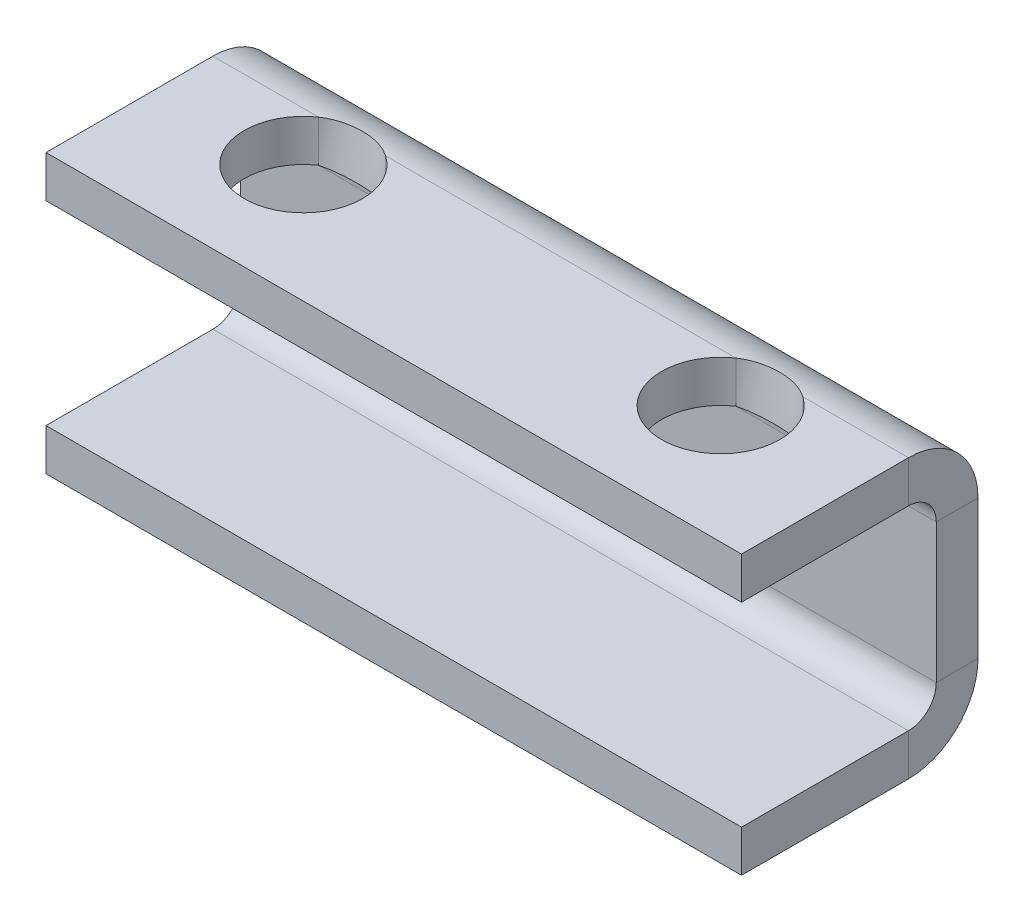
ISO-10303-21;
HEADER;
FILE_DESCRIPTION(('STEP AP214'),'2;1');
FILE_NAME('part.step','',(''),(''),'','','');
FILE_SCHEMA(('AUTOMOTIVE_DESIGN { 1 0 10303 214 1 1 1 1 }'));
ENDSEC;
DATA;
#1=APPLICATION_CONTEXT('core data for automotive mechanical design processes');
#2=APPLICATION_PROTOCOL_DEFINITION('international standard','automotive_design',2000,#1);
#3=PRODUCT_CONTEXT('',#1,'mechanical');
#4=PRODUCT('Part','Part','',(#3));
#5=PRODUCT_RELATED_PRODUCT_CATEGORY('part','',(#4));
#6=PRODUCT_DEFINITION_FORMATION('','',#4);
#7=PRODUCT_DEFINITION_CONTEXT('part definition',#1,'design');
#8=PRODUCT_DEFINITION('design','',#6,#7);
#9=PRODUCT_DEFINITION_SHAPE('','',#8);
#10=(LENGTH_UNIT() NAMED_UNIT(*) SI_UNIT(.MILLI.,.METRE.));
#11=(NAMED_UNIT(*) PLANE_ANGLE_UNIT() SI_UNIT($,.RADIAN.));
#12=(NAMED_UNIT(*) SI_UNIT($,.STERADIAN.) SOLID_ANGLE_UNIT());
#13=UNCERTAINTY_MEASURE_WITH_UNIT(LENGTH_MEASURE(1.E-05),#10,'distance_accuracy_value','');
#14=(GEOMETRIC_REPRESENTATION_CONTEXT(3) GLOBAL_UNCERTAINTY_ASSIGNED_CONTEXT((#13)) GLOBAL_UNIT_ASSIGNED_CONTEXT((#10,
#11,#12)) REPRESENTATION_CONTEXT('',''));
#15=CARTESIAN_POINT('',(0.,0.,0.));
#16=DIRECTION('',(0.,0.,1.));
#17=DIRECTION('',(1.,0.,0.));
#18=AXIS2_PLACEMENT_3D('',#15,#16,#17);
#19=CARTESIAN_POINT('',(-25.1781746195034,20.,-28.9999999999999));
#20=CARTESIAN_POINT('',(-25.8881448454651,20.,-29.4890503507054));
#21=CARTESIAN_POINT('',(-26.6525228479121,19.9662598890292,-29.8599474567213));
#22=CARTESIAN_POINT('',(-27.879730082586,19.9233446593499,-30.2424541129357));
#23=CARTESIAN_POINT('',(-28.3002915042684,19.9101349975319,-30.3391805559646));
#24=CARTESIAN_POINT('',(-29.1413465360991,19.8919903584384,-30.4672106117877));
#25=CARTESIAN_POINT('',(-29.5650505993346,19.8869216632596,-30.4995933417468));
#26=CARTESIAN_POINT('',(-30.4189072474882,19.8867994183876,-30.5003990891138));
#27=CARTESIAN_POINT('',(-30.851448520052,19.8918730372488,-30.4679956067223));
#28=CARTESIAN_POINT('',(-31.6948534565829,19.9099926816771,-30.3402269716403));
#29=CARTESIAN_POINT('',(-32.1089223545109,19.9229784768555,-30.2452166993051));
#30=CARTESIAN_POINT('',(-33.3285863915305,19.9655395361904,-29.8673451873898));
#31=CARTESIAN_POINT('',(-34.1158003298536,20.,-29.4863327869223));
#32=CARTESIAN_POINT('',(-34.8218253804965,20.,-28.9999999999999));
#33=CARTESIAN_POINT('',(-25.1781746195034,14.,-28.9999999999999));
#34=CARTESIAN_POINT('',(-25.8886428200055,14.,-29.1957573486408));
#35=CARTESIAN_POINT('',(-26.6525228479122,13.9865039556117,-29.3439789826884));
#36=CARTESIAN_POINT('',(-27.879730082586,13.9693378637399,-29.4969816451742));
#37=CARTESIAN_POINT('',(-28.3002915042684,13.9640539990128,-29.5356722223857));
#38=CARTESIAN_POINT('',(-29.1413465360991,13.9567961433753,-29.586884244715));
#39=CARTESIAN_POINT('',(-29.5650505993346,13.9547686653038,-29.5998373366986));
#40=CARTESIAN_POINT('',(-30.4189072474882,13.954719767355,-29.6001596356454));
#41=CARTESIAN_POINT('',(-30.8514485200521,13.9567492148995,-29.5871982426888));
#42=CARTESIAN_POINT('',(-31.6948534565829,13.9639970726708,-29.536090788656));
#43=CARTESIAN_POINT('',(-32.1089223545109,13.9691913907422,-29.498086679722));
#44=CARTESIAN_POINT('',(-33.3285863915305,13.9862158144761,-29.3469380749559));
#45=CARTESIAN_POINT('',(-34.1163575468358,14.,-29.1943795831695));
#46=CARTESIAN_POINT('',(-34.8218253804966,14.,-28.9999999999999));
#47=B_SPLINE_SURFACE_WITH_KNOTS('',1,3,((#19,#20,#21,#22,#23,#24,#25,#26,#27,#28,#29,#30,#31,
#32),(#33,#34,#35,#36,#37,#38,#39,#40,#41,#42,#43,#44,#45,#46)),.UNSPECIFIED.,.F.,.F.,.F.,(2,2),
(4,2,2,2,2,2,4),(0.,1.),(0.,0.00254959814953399,0.00382439722430098,0.00509919629906798,
0.00637399537383497,0.00764879444860197,0.010198392598136),.UNSPECIFIED.);
#48=CARTESIAN_POINT('',(-34.8218253804965,20.,-28.9999999999999));
#49=CARTESIAN_POINT('',(-34.8218253804966,14.,-28.9999999999999));
#50=B_SPLINE_CURVE_WITH_KNOTS('',1,(#48,#49),.UNSPECIFIED.,.F.,.F.,(2,2),(0.,1.),.UNSPECIFIED.);
#51=CARTESIAN_POINT('',(-34.8218253804966,14.,-28.9999999999999));
#52=VERTEX_POINT('',#51);
#53=CARTESIAN_POINT('',(-34.8218253804965,20.,-28.9999999999999));
#54=VERTEX_POINT('',#53);
#55=EDGE_CURVE('E11',#52,#54,#50,.F.);
#56=CARTESIAN_POINT('',(-34.8218253804966,14.,-28.9999999999999));
#57=CARTESIAN_POINT('',(-34.1163575468358,14.,-29.1943795831695));
#58=CARTESIAN_POINT('',(-33.3285863915305,13.9862158144761,-29.3469380749559));
#59=CARTESIAN_POINT('',(-32.1089223545109,13.9691913907422,-29.498086679722));
#60=CARTESIAN_POINT('',(-31.6948534565829,13.9639970726708,-29.536090788656));
#61=CARTESIAN_POINT('',(-30.8514485200521,13.9567492148995,-29.5871982426888));
#62=CARTESIAN_POINT('',(-30.4189072474882,13.954719767355,-29.6001596356454));
#63=CARTESIAN_POINT('',(-29.5650505993346,13.9547686653038,-29.5998373366986));
#64=CARTESIAN_POINT('',(-29.1413465360991,13.9567961433753,-29.586884244715));
#65=CARTESIAN_POINT('',(-28.3002915042684,13.9640539990128,-29.5356722223857));
#66=CARTESIAN_POINT('',(-27.879730082586,13.9693378637399,-29.4969816451742));
#67=CARTESIAN_POINT('',(-26.6525228479122,13.9865039556117,-29.3439789826884));
#68=CARTESIAN_POINT('',(-25.8886428200055,14.,-29.1957573486408));
#69=CARTESIAN_POINT('',(-25.1781746195034,14.,-28.9999999999999));
#70=B_SPLINE_CURVE_WITH_KNOTS('',3,(#56,#57,#58,#59,#60,#61,#62,#63,#64,#65,#66,#67,#68,#69),
.UNSPECIFIED.,.F.,.F.,(4,2,2,2,2,2,4),(0.,0.00254959814953399,0.00382439722430098,
0.00509919629906798,0.00637399537383497,0.00764879444860197,0.010198392598136),.UNSPECIFIED.);
#71=CARTESIAN_POINT('',(-25.1781746195034,14.,-28.9999999999999));
#72=VERTEX_POINT('',#71);
#73=EDGE_CURVE('E140',#72,#52,#70,.F.);
#74=CARTESIAN_POINT('',(-25.1781746195034,14.,-28.9999999999999));
#75=CARTESIAN_POINT('',(-25.1781746195034,20.,-28.9999999999999));
#76=B_SPLINE_CURVE_WITH_KNOTS('',1,(#74,#75),.UNSPECIFIED.,.F.,.F.,(2,2),(0.,1.),.UNSPECIFIED.);
#77=CARTESIAN_POINT('',(-25.1781746195034,20.,-28.9999999999999));
#78=VERTEX_POINT('',#77);
#79=EDGE_CURVE('E52',#72,#78,#76,.T.);
#80=CARTESIAN_POINT('',(-25.1781746195034,20.,-28.9999999999999));
#81=CARTESIAN_POINT('',(-25.8881448454651,20.,-29.4890503507054));
#82=CARTESIAN_POINT('',(-26.6525228479121,19.9662598890292,-29.8599474567213));
#83=CARTESIAN_POINT('',(-27.879730082586,19.9233446593499,-30.2424541129357));
#84=CARTESIAN_POINT('',(-28.3002915042684,19.9101349975319,-30.3391805559646));
#85=CARTESIAN_POINT('',(-29.1413465360991,19.8919903584384,-30.4672106117877));
#86=CARTESIAN_POINT('',(-29.5650505993346,19.8869216632596,-30.4995933417468));
#87=CARTESIAN_POINT('',(-30.4189072474882,19.8867994183876,-30.5003990891138));
#88=CARTESIAN_POINT('',(-30.851448520052,19.8918730372488,-30.4679956067223));
#89=CARTESIAN_POINT('',(-31.6948534565829,19.9099926816771,-30.3402269716403));
#90=CARTESIAN_POINT('',(-32.1089223545109,19.9229784768555,-30.2452166993051));
#91=CARTESIAN_POINT('',(-33.3285863915305,19.9655395361904,-29.8673451873898));
#92=CARTESIAN_POINT('',(-34.1158003298536,20.,-29.4863327869223));
#93=CARTESIAN_POINT('',(-34.8218253804965,20.,-28.9999999999999));
#94=B_SPLINE_CURVE_WITH_KNOTS('',3,(#80,#81,#82,#83,#84,#85,#86,#87,#88,#89,#90,#91,#92,#93),
.UNSPECIFIED.,.F.,.F.,(4,2,2,2,2,2,4),(0.,0.00254959814953399,0.00382439722430098,
0.00509919629906798,0.00637399537383497,0.00764879444860197,0.010198392598136),.UNSPECIFIED.);
#95=EDGE_CURVE('E323',#78,#54,#94,.T.);
#96=ORIENTED_EDGE('',*,*,#55,.F.);
#97=ORIENTED_EDGE('',*,*,#73,.F.);
#98=ORIENTED_EDGE('',*,*,#79,.T.);
#99=ORIENTED_EDGE('',*,*,#95,.T.);
#100=EDGE_LOOP('',(#96,#97,#98,#99));
#101=FACE_BOUND('',#100,.T.);
#102=ADVANCED_FACE('F40',(#101),#47,.F.);
#103=CARTESIAN_POINT('',(50.,-10.,-28.9999999999999));
#104=DIRECTION('',(-1.,0.,0.));
#105=DIRECTION('',(0.,0.,1.));
#106=AXIS2_PLACEMENT_3D('',#103,#104,#105);
#107=PLANE('',#106);
#108=DIRECTION('',(0.,0.,-1.));
#109=VECTOR('',#108,1.);
#110=CARTESIAN_POINT('',(50.,-10.,-38.9999999999999));
#111=LINE('',#110,#109);
#112=CARTESIAN_POINT('',(50.,-10.,-32.9999999999999));
#113=VERTEX_POINT('',#112);
#114=CARTESIAN_POINT('',(50.,-10.,-38.9999999999999));
#115=VERTEX_POINT('',#114);
#116=EDGE_CURVE('E132',#113,#115,#111,.T.);
#117=ORIENTED_EDGE('',*,*,#116,.F.);
#118=CARTESIAN_POINT('',(50.,-10.,-28.9999999999999));
#119=DIRECTION('',(1.,0.,0.));
#120=DIRECTION('',(0.,0.,-1.));
#121=AXIS2_PLACEMENT_3D('',#118,#119,#120);
#122=CIRCLE('',#121,4.);
#123=CARTESIAN_POINT('',(50.,-14.,-28.9999999999998));
#124=VERTEX_POINT('',#123);
#125=EDGE_CURVE('E410',#124,#113,#122,.T.);
#126=ORIENTED_EDGE('',*,*,#125,.F.);
#127=DIRECTION('',(0.,-1.,0.));
#128=VECTOR('',#127,1.);
#129=CARTESIAN_POINT('',(50.,-20.,-28.9999999999998));
#130=LINE('',#129,#128);
#131=CARTESIAN_POINT('',(50.,-20.,-28.9999999999998));
#132=VERTEX_POINT('',#131);
#133=EDGE_CURVE('E228',#124,#132,#130,.T.);
#134=ORIENTED_EDGE('',*,*,#133,.T.);
#135=CARTESIAN_POINT('',(50.,-10.,-28.9999999999999));
#136=DIRECTION('',(1.,0.,0.));
#137=DIRECTION('',(0.,0.,-1.));
#138=AXIS2_PLACEMENT_3D('',#135,#136,#137);
#139=CIRCLE('',#138,10.);
#140=EDGE_CURVE('E431',#132,#115,#139,.T.);
#141=ORIENTED_EDGE('',*,*,#140,.T.);
#142=EDGE_LOOP('',(#117,#126,#134,#141));
#143=FACE_BOUND('',#142,.T.);
#144=ADVANCED_FACE('F181',(#143),#107,.F.);
#145=CARTESIAN_POINT('',(50.,-20.,-4.99999999999985));
#146=DIRECTION('',(-1.,0.,0.));
#147=DIRECTION('',(0.,0.,-1.));
#148=AXIS2_PLACEMENT_3D('',#145,#146,#147);
#149=PLANE('',#148);
#150=ORIENTED_EDGE('',*,*,#133,.F.);
#151=DIRECTION('',(0.,0.,-1.));
#152=VECTOR('',#151,1.);
#153=CARTESIAN_POINT('',(50.,-14.,-4.99999999999985));
#154=LINE('',#153,#152);
#155=CARTESIAN_POINT('',(50.,-14.,-4.99999999999985));
#156=VERTEX_POINT('',#155);
#157=EDGE_CURVE('E357',#156,#124,#154,.T.);
#158=ORIENTED_EDGE('',*,*,#157,.F.);
#159=DIRECTION('',(0.,-1.,0.));
#160=VECTOR('',#159,1.);
#161=CARTESIAN_POINT('',(50.,-20.,-4.99999999999985));
#162=LINE('',#161,#160);
#163=CARTESIAN_POINT('',(50.,-20.,-4.99999999999985));
#164=VERTEX_POINT('',#163);
#165=EDGE_CURVE('E232',#156,#164,#162,.T.);
#166=ORIENTED_EDGE('',*,*,#165,.T.);
#167=DIRECTION('',(0.,0.,-1.));
#168=VECTOR('',#167,1.);
#169=CARTESIAN_POINT('',(50.,-20.,-4.99999999999985));
#170=LINE('',#169,#168);
#171=EDGE_CURVE('E565',#164,#132,#170,.T.);
#172=ORIENTED_EDGE('',*,*,#171,.T.);
#173=EDGE_LOOP('',(#150,#158,#166,#172));
#174=FACE_BOUND('',#173,.T.);
#175=ADVANCED_FACE('F702',(#174),#149,.F.);
#176=CARTESIAN_POINT('',(-102.497618993627,-20.,-4.99999999999985));
#177=DIRECTION('',(0.,0.,-1.));
#178=DIRECTION('',(1.,0.,0.));
#179=AXIS2_PLACEMENT_3D('',#176,#177,#178);
#180=PLANE('',#179);
#181=ORIENTED_EDGE('',*,*,#165,.F.);
#182=DIRECTION('',(1.,0.,0.));
#183=VECTOR('',#182,1.);
#184=CARTESIAN_POINT('',(-102.497618993627,-14.,-4.99999999999985));
#185=LINE('',#184,#183);
#186=CARTESIAN_POINT('',(-50.,-14.,-4.99999999999985));
#187=VERTEX_POINT('',#186);
#188=EDGE_CURVE('E623',#187,#156,#185,.T.);
#189=ORIENTED_EDGE('',*,*,#188,.F.);
#190=DIRECTION('',(0.,-1.,0.));
#191=VECTOR('',#190,1.);
#192=CARTESIAN_POINT('',(-50.,-20.,-4.99999999999985));
#193=LINE('',#192,#191);
#194=CARTESIAN_POINT('',(-50.,-20.,-4.99999999999985));
#195=VERTEX_POINT('',#194);
#196=EDGE_CURVE('E236',#187,#195,#193,.T.);
#197=ORIENTED_EDGE('',*,*,#196,.T.);
#198=DIRECTION('',(1.,0.,0.));
#199=VECTOR('',#198,1.);
#200=CARTESIAN_POINT('',(-102.497618993627,-20.,-4.99999999999985));
#201=LINE('',#200,#199);
#202=EDGE_CURVE('E158',#195,#164,#201,.T.);
#203=ORIENTED_EDGE('',*,*,#202,.T.);
#204=EDGE_LOOP('',(#181,#189,#197,#203));
#205=FACE_BOUND('',#204,.T.);
#206=ADVANCED_FACE('F584',(#205),#180,.F.);
#207=CARTESIAN_POINT('',(-50.,-20.,-4.99999999999985));
#208=DIRECTION('',(-1.,0.,0.));
#209=DIRECTION('',(0.,0.,-1.));
#210=AXIS2_PLACEMENT_3D('',#207,#208,#209);
#211=PLANE('',#210);
#212=ORIENTED_EDGE('',*,*,#196,.F.);
#213=DIRECTION('',(0.,0.,-1.));
#214=VECTOR('',#213,1.);
#215=CARTESIAN_POINT('',(-50.,-14.,-4.99999999999985));
#216=LINE('',#215,#214);
#217=CARTESIAN_POINT('',(-50.,-14.,-28.9999999999999));
#218=VERTEX_POINT('',#217);
#219=EDGE_CURVE('E358',#218,#187,#216,.F.);
#220=ORIENTED_EDGE('',*,*,#219,.F.);
#221=DIRECTION('',(0.,-1.,0.));
#222=VECTOR('',#221,1.);
#223=CARTESIAN_POINT('',(-50.,-20.,-28.9999999999999));
#224=LINE('',#223,#222);
#225=CARTESIAN_POINT('',(-50.,-20.,-28.9999999999999));
#226=VERTEX_POINT('',#225);
#227=EDGE_CURVE('E240',#218,#226,#224,.T.);
#228=ORIENTED_EDGE('',*,*,#227,.T.);
#229=DIRECTION('',(0.,0.,-1.));
#230=VECTOR('',#229,1.);
#231=CARTESIAN_POINT('',(-50.,-20.,-4.99999999999985));
#232=LINE('',#231,#230);
#233=EDGE_CURVE('E574',#226,#195,#232,.F.);
#234=ORIENTED_EDGE('',*,*,#233,.T.);
#235=EDGE_LOOP('',(#212,#220,#228,#234));
#236=FACE_BOUND('',#235,.T.);
#237=ADVANCED_FACE('F593',(#236),#211,.T.);
#238=CARTESIAN_POINT('',(-50.,-10.,-28.9999999999999));
#239=DIRECTION('',(1.,0.,0.));
#240=DIRECTION('',(0.,0.,-1.));
#241=AXIS2_PLACEMENT_3D('',#238,#239,#240);
#242=PLANE('',#241);
#243=ORIENTED_EDGE('',*,*,#227,.F.);
#244=CARTESIAN_POINT('',(-50.,-10.,-28.9999999999999));
#245=DIRECTION('',(1.,0.,0.));
#246=DIRECTION('',(0.,0.,-1.));
#247=AXIS2_PLACEMENT_3D('',#244,#245,#246);
#248=CIRCLE('',#247,4.);
#249=CARTESIAN_POINT('',(-50.,-10.,-32.9999999999999));
#250=VERTEX_POINT('',#249);
#251=EDGE_CURVE('E601',#250,#218,#248,.F.);
#252=ORIENTED_EDGE('',*,*,#251,.F.);
#253=DIRECTION('',(0.,0.,-1.));
#254=VECTOR('',#253,1.);
#255=CARTESIAN_POINT('',(-50.,-10.,-38.9999999999999));
#256=LINE('',#255,#254);
#257=CARTESIAN_POINT('',(-50.,-10.,-38.9999999999999));
#258=VERTEX_POINT('',#257);
#259=EDGE_CURVE('E244',#250,#258,#256,.T.);
#260=ORIENTED_EDGE('',*,*,#259,.T.);
#261=CARTESIAN_POINT('',(-50.,-10.,-28.9999999999999));
#262=DIRECTION('',(-1.,0.,0.));
#263=DIRECTION('',(0.,0.,1.));
#264=AXIS2_PLACEMENT_3D('',#261,#262,#263);
#265=CIRCLE('',#264,10.);
#266=EDGE_CURVE('E529',#258,#226,#265,.T.);
#267=ORIENTED_EDGE('',*,*,#266,.T.);
#268=EDGE_LOOP('',(#243,#252,#260,#267));
#269=FACE_BOUND('',#268,.T.);
#270=ADVANCED_FACE('F599',(#269),#242,.F.);
#271=CARTESIAN_POINT('',(-50.,-14.,-38.9999999999999));
#272=DIRECTION('',(-1.,0.,0.));
#273=DIRECTION('',(0.,1.,0.));
#274=AXIS2_PLACEMENT_3D('',#271,#272,#273);
#275=PLANE('',#274);
#276=ORIENTED_EDGE('',*,*,#259,.F.);
#277=DIRECTION('',(0.,1.,0.));
#278=VECTOR('',#277,1.);
#279=CARTESIAN_POINT('',(-50.,-14.,-32.9999999999999));
#280=LINE('',#279,#278);
#281=CARTESIAN_POINT('',(-50.,10.,-32.9999999999999));
#282=VERTEX_POINT('',#281);
#283=EDGE_CURVE('E348',#282,#250,#280,.F.);
#284=ORIENTED_EDGE('',*,*,#283,.F.);
#285=DIRECTION('',(0.,0.,-1.));
#286=VECTOR('',#285,1.);
#287=CARTESIAN_POINT('',(-50.,10.,-38.9999999999999));
#288=LINE('',#287,#286);
#289=CARTESIAN_POINT('',(-50.,10.,-38.9999999999999));
#290=VERTEX_POINT('',#289);
#291=EDGE_CURVE('E248',#282,#290,#288,.T.);
#292=ORIENTED_EDGE('',*,*,#291,.T.);
#293=DIRECTION('',(0.,1.,0.));
#294=VECTOR('',#293,1.);
#295=CARTESIAN_POINT('',(-50.,-14.,-38.9999999999999));
#296=LINE('',#295,#294);
#297=EDGE_CURVE('E534',#290,#258,#296,.F.);
#298=ORIENTED_EDGE('',*,*,#297,.T.);
#299=EDGE_LOOP('',(#276,#284,#292,#298));
#300=FACE_BOUND('',#299,.T.);
#301=ADVANCED_FACE('F657',(#300),#275,.T.);
#302=CARTESIAN_POINT('',(-50.,10.,-28.9999999999999));
#303=DIRECTION('',(1.,0.,0.));
#304=DIRECTION('',(0.,0.,-1.));
#305=AXIS2_PLACEMENT_3D('',#302,#303,#304);
#306=PLANE('',#305);
#307=ORIENTED_EDGE('',*,*,#291,.F.);
#308=CARTESIAN_POINT('',(-50.,10.,-28.9999999999999));
#309=DIRECTION('',(1.,0.,0.));
#310=DIRECTION('',(0.,0.,-1.));
#311=AXIS2_PLACEMENT_3D('',#308,#309,#310);
#312=CIRCLE('',#311,4.);
#313=CARTESIAN_POINT('',(-50.,14.,-28.9999999999999));
#314=VERTEX_POINT('',#313);
#315=EDGE_CURVE('E159',#314,#282,#312,.F.);
#316=ORIENTED_EDGE('',*,*,#315,.F.);
#317=DIRECTION('',(0.,1.,0.));
#318=VECTOR('',#317,1.);
#319=CARTESIAN_POINT('',(-50.,20.,-28.9999999999999));
#320=LINE('',#319,#318);
#321=CARTESIAN_POINT('',(-50.,20.,-28.9999999999999));
#322=VERTEX_POINT('',#321);
#323=EDGE_CURVE('E252',#314,#322,#320,.T.);
#324=ORIENTED_EDGE('',*,*,#323,.T.);
#325=CARTESIAN_POINT('',(-50.,10.,-28.9999999999999));
#326=DIRECTION('',(-1.,0.,0.));
#327=DIRECTION('',(0.,0.,1.));
#328=AXIS2_PLACEMENT_3D('',#325,#326,#327);
#329=CIRCLE('',#328,10.);
#330=EDGE_CURVE('E326',#322,#290,#329,.T.);
#331=ORIENTED_EDGE('',*,*,#330,.T.);
#332=EDGE_LOOP('',(#307,#316,#324,#331));
#333=FACE_BOUND('',#332,.T.);
#334=ADVANCED_FACE('F685',(#333),#306,.F.);
#335=CARTESIAN_POINT('',(-50.,20.,-32.9999999999999));
#336=DIRECTION('',(1.,0.,0.));
#337=DIRECTION('',(0.,0.,-1.));
#338=AXIS2_PLACEMENT_3D('',#335,#336,#337);
#339=PLANE('',#338);
#340=ORIENTED_EDGE('',*,*,#323,.F.);
#341=DIRECTION('',(0.,0.,1.));
#342=VECTOR('',#341,1.);
#343=CARTESIAN_POINT('',(-50.,14.,-32.9999999999999));
#344=LINE('',#343,#342);
#345=CARTESIAN_POINT('',(-50.,14.,-4.99999999999985));
#346=VERTEX_POINT('',#345);
#347=EDGE_CURVE('E403',#346,#314,#344,.F.);
#348=ORIENTED_EDGE('',*,*,#347,.F.);
#349=DIRECTION('',(0.,1.,0.));
#350=VECTOR('',#349,1.);
#351=CARTESIAN_POINT('',(-50.,20.,-4.99999999999985));
#352=LINE('',#351,#350);
#353=CARTESIAN_POINT('',(-50.,20.,-4.99999999999985));
#354=VERTEX_POINT('',#353);
#355=EDGE_CURVE('E256',#346,#354,#352,.T.);
#356=ORIENTED_EDGE('',*,*,#355,.T.);
#357=DIRECTION('',(0.,0.,-1.));
#358=VECTOR('',#357,1.);
#359=CARTESIAN_POINT('',(-50.,20.,-32.9999999999999));
#360=LINE('',#359,#358);
#361=EDGE_CURVE('E443',#354,#322,#360,.T.);
#362=ORIENTED_EDGE('',*,*,#361,.T.);
#363=EDGE_LOOP('',(#340,#348,#356,#362));
#364=FACE_BOUND('',#363,.T.);
#365=ADVANCED_FACE('F676',(#364),#339,.F.);
#366=CARTESIAN_POINT('',(-102.497618993627,20.,-4.99999999999985));
#367=DIRECTION('',(0.,0.,1.));
#368=DIRECTION('',(1.,0.,0.));
#369=AXIS2_PLACEMENT_3D('',#366,#367,#368);
#370=PLANE('',#369);
#371=ORIENTED_EDGE('',*,*,#355,.F.);
#372=DIRECTION('',(1.,0.,0.));
#373=VECTOR('',#372,1.);
#374=CARTESIAN_POINT('',(-102.497618993627,14.,-4.99999999999985));
#375=LINE('',#374,#373);
#376=CARTESIAN_POINT('',(50.,14.,-4.99999999999985));
#377=VERTEX_POINT('',#376);
#378=EDGE_CURVE('E666',#346,#377,#375,.T.);
#379=ORIENTED_EDGE('',*,*,#378,.T.);
#380=DIRECTION('',(0.,1.,0.));
#381=VECTOR('',#380,1.);
#382=CARTESIAN_POINT('',(50.,20.,-4.99999999999985));
#383=LINE('',#382,#381);
#384=CARTESIAN_POINT('',(50.,20.,-4.99999999999985));
#385=VERTEX_POINT('',#384);
#386=EDGE_CURVE('E260',#377,#385,#383,.T.);
#387=ORIENTED_EDGE('',*,*,#386,.T.);
#388=DIRECTION('',(1.,0.,0.));
#389=VECTOR('',#388,1.);
#390=CARTESIAN_POINT('',(-102.497618993627,20.,-4.99999999999985));
#391=LINE('',#390,#389);
#392=EDGE_CURVE('E494',#354,#385,#391,.T.);
#393=ORIENTED_EDGE('',*,*,#392,.F.);
#394=EDGE_LOOP('',(#371,#379,#387,#393));
#395=FACE_BOUND('',#394,.T.);
#396=ADVANCED_FACE('F674',(#395),#370,.T.);
#397=CARTESIAN_POINT('',(50.,20.,-32.9999999999999));
#398=DIRECTION('',(-1.,0.,0.));
#399=DIRECTION('',(0.,0.,1.));
#400=AXIS2_PLACEMENT_3D('',#397,#398,#399);
#401=PLANE('',#400);
#402=ORIENTED_EDGE('',*,*,#386,.F.);
#403=DIRECTION('',(0.,0.,1.));
#404=VECTOR('',#403,1.);
#405=CARTESIAN_POINT('',(50.,14.,-32.9999999999999));
#406=LINE('',#405,#404);
#407=CARTESIAN_POINT('',(50.,14.,-28.9999999999999));
#408=VERTEX_POINT('',#407);
#409=EDGE_CURVE('E398',#408,#377,#406,.T.);
#410=ORIENTED_EDGE('',*,*,#409,.F.);
#411=DIRECTION('',(0.,1.,0.));
#412=VECTOR('',#411,1.);
#413=CARTESIAN_POINT('',(50.,20.,-28.9999999999999));
#414=LINE('',#413,#412);
#415=CARTESIAN_POINT('',(50.,20.,-28.9999999999999));
#416=VERTEX_POINT('',#415);
#417=EDGE_CURVE('E223',#408,#416,#414,.T.);
#418=ORIENTED_EDGE('',*,*,#417,.T.);
#419=DIRECTION('',(0.,0.,1.));
#420=VECTOR('',#419,1.);
#421=CARTESIAN_POINT('',(50.,20.,-32.9999999999999));
#422=LINE('',#421,#420);
#423=EDGE_CURVE('E438',#416,#385,#422,.T.);
#424=ORIENTED_EDGE('',*,*,#423,.T.);
#425=EDGE_LOOP('',(#402,#410,#418,#424));
#426=FACE_BOUND('',#425,.T.);
#427=ADVANCED_FACE('F506',(#426),#401,.F.);
#428=CARTESIAN_POINT('',(50.,10.,-28.9999999999999));
#429=DIRECTION('',(-1.,0.,0.));
#430=DIRECTION('',(0.,0.,1.));
#431=AXIS2_PLACEMENT_3D('',#428,#429,#430);
#432=PLANE('',#431);
#433=ORIENTED_EDGE('',*,*,#417,.F.);
#434=CARTESIAN_POINT('',(50.,10.,-28.9999999999999));
#435=DIRECTION('',(1.,0.,0.));
#436=DIRECTION('',(0.,0.,-1.));
#437=AXIS2_PLACEMENT_3D('',#434,#435,#436);
#438=CIRCLE('',#437,4.);
#439=CARTESIAN_POINT('',(50.,10.,-32.9999999999999));
#440=VERTEX_POINT('',#439);
#441=EDGE_CURVE('E364',#440,#408,#438,.T.);
#442=ORIENTED_EDGE('',*,*,#441,.F.);
#443=DIRECTION('',(0.,0.,-1.));
#444=VECTOR('',#443,1.);
#445=CARTESIAN_POINT('',(50.,10.,-38.9999999999999));
#446=LINE('',#445,#444);
#447=CARTESIAN_POINT('',(50.,10.,-38.9999999999999));
#448=VERTEX_POINT('',#447);
#449=EDGE_CURVE('E219',#440,#448,#446,.T.);
#450=ORIENTED_EDGE('',*,*,#449,.T.);
#451=CARTESIAN_POINT('',(50.,10.,-28.9999999999999));
#452=DIRECTION('',(1.,0.,0.));
#453=DIRECTION('',(0.,0.,-1.));
#454=AXIS2_PLACEMENT_3D('',#451,#452,#453);
#455=CIRCLE('',#454,10.);
#456=EDGE_CURVE('E331',#448,#416,#455,.T.);
#457=ORIENTED_EDGE('',*,*,#456,.T.);
#458=EDGE_LOOP('',(#433,#442,#450,#457));
#459=FACE_BOUND('',#458,.T.);
#460=ADVANCED_FACE('F287',(#459),#432,.F.);
#461=CARTESIAN_POINT('',(34.8218253804965,20.,-28.9999999999999));
#462=CARTESIAN_POINT('',(34.1118551545348,20.,-29.4890503507054));
#463=CARTESIAN_POINT('',(33.3474771520878,19.9662598890292,-29.8599474567213));
#464=CARTESIAN_POINT('',(32.1202699174139,19.9233446593499,-30.2424541129357));
#465=CARTESIAN_POINT('',(31.6997084957316,19.9101349975319,-30.3391805559645));
#466=CARTESIAN_POINT('',(30.8586534639009,19.8919903584384,-30.4672106117876));
#467=CARTESIAN_POINT('',(30.4349494006654,19.8869216632596,-30.4995933417467));
#468=CARTESIAN_POINT('',(29.5810927525118,19.8867994183876,-30.5003990891138));
#469=CARTESIAN_POINT('',(29.148551479948,19.8918730372488,-30.4679956067223));
#470=CARTESIAN_POINT('',(28.3051465434171,19.9099926816771,-30.3402269716403));
#471=CARTESIAN_POINT('',(27.8910776454892,19.9229784768555,-30.2452166993051));
#472=CARTESIAN_POINT('',(26.6714136084696,19.9655395361904,-29.8673451873898));
#473=CARTESIAN_POINT('',(25.8841996701465,20.,-29.4863327869222));
#474=CARTESIAN_POINT('',(25.1781746195035,20.,-28.9999999999998));
#475=CARTESIAN_POINT('',(34.8218253804965,14.,-28.9999999999999));
#476=CARTESIAN_POINT('',(34.1113571799944,14.,-29.1957573486408));
#477=CARTESIAN_POINT('',(33.3474771520877,13.9865039556117,-29.3439789826884));
#478=CARTESIAN_POINT('',(32.1202699174139,13.9693378637399,-29.4969816451742));
#479=CARTESIAN_POINT('',(31.6997084957315,13.9640539990128,-29.5356722223857));
#480=CARTESIAN_POINT('',(30.8586534639009,13.9567961433753,-29.586884244715));
#481=CARTESIAN_POINT('',(30.4349494006654,13.9547686653038,-29.5998373366986));
#482=CARTESIAN_POINT('',(29.5810927525118,13.954719767355,-29.6001596356454));
#483=CARTESIAN_POINT('',(29.1485514799479,13.9567492148995,-29.5871982426888));
#484=CARTESIAN_POINT('',(28.3051465434171,13.9639970726708,-29.536090788656));
#485=CARTESIAN_POINT('',(27.8910776454891,13.9691913907422,-29.498086679722));
#486=CARTESIAN_POINT('',(26.6714136084695,13.9862158144761,-29.3469380749558));
#487=CARTESIAN_POINT('',(25.8836424531643,14.,-29.1943795831695));
#488=CARTESIAN_POINT('',(25.1781746195035,14.,-28.9999999999999));
#489=B_SPLINE_SURFACE_WITH_KNOTS('',1,3,((#461,#462,#463,#464,#465,#466,#467,#468,#469,#470,
#471,#472,#473,#474),(#475,#476,#477,#478,#479,#480,#481,#482,#483,#484,#485,#486,#487,#488)),
.UNSPECIFIED.,.F.,.F.,.F.,(2,2),(4,2,2,2,2,2,4),(0.,1.),(0.,0.00254959814953394,
0.0038243972243009,0.00509919629906787,0.00637399537383483,0.0076487944486018,
0.0101983925981357),.UNSPECIFIED.);
#490=CARTESIAN_POINT('',(25.1781746195035,20.,-28.9999999999998));
#491=CARTESIAN_POINT('',(25.1781746195035,14.,-28.9999999999999));
#492=B_SPLINE_CURVE_WITH_KNOTS('',1,(#490,#491),.UNSPECIFIED.,.F.,.F.,(2,2),(0.,1.),.UNSPECIFIED.);
#493=CARTESIAN_POINT('',(25.1781746195035,14.,-28.9999999999999));
#494=VERTEX_POINT('',#493);
#495=CARTESIAN_POINT('',(25.1781746195036,20.,-28.9999999999999));
#496=VERTEX_POINT('',#495);
#497=EDGE_CURVE('E224',#494,#496,#492,.F.);
#498=CARTESIAN_POINT('',(25.1781746195035,14.,-28.9999999999999));
#499=CARTESIAN_POINT('',(25.8836424531643,14.,-29.1943795831695));
#500=CARTESIAN_POINT('',(26.6714136084695,13.9862158144761,-29.3469380749558));
#501=CARTESIAN_POINT('',(27.8910776454891,13.9691913907422,-29.498086679722));
#502=CARTESIAN_POINT('',(28.3051465434171,13.9639970726708,-29.536090788656));
#503=CARTESIAN_POINT('',(29.1485514799479,13.9567492148995,-29.5871982426888));
#504=CARTESIAN_POINT('',(29.5810927525118,13.954719767355,-29.6001596356454));
#505=CARTESIAN_POINT('',(30.4349494006654,13.9547686653038,-29.5998373366986));
#506=CARTESIAN_POINT('',(30.8586534639009,13.9567961433753,-29.586884244715));
#507=CARTESIAN_POINT('',(31.6997084957315,13.9640539990128,-29.5356722223857));
#508=CARTESIAN_POINT('',(32.1202699174139,13.9693378637399,-29.4969816451742));
#509=CARTESIAN_POINT('',(33.3474771520877,13.9865039556117,-29.3439789826884));
#510=CARTESIAN_POINT('',(34.1113571799944,14.,-29.1957573486408));
#511=CARTESIAN_POINT('',(34.8218253804965,14.,-28.9999999999999));
#512=B_SPLINE_CURVE_WITH_KNOTS('',3,(#498,#499,#500,#501,#502,#503,#504,#505,#506,#507,#508,
#509,#510,#511),.UNSPECIFIED.,.F.,.F.,(4,2,2,2,2,2,4),(0.,0.00254959814953394,
0.0038243972243009,0.00509919629906787,0.00637399537383483,0.00764879444860179,
0.0101983925981357),.UNSPECIFIED.);
#513=CARTESIAN_POINT('',(34.8218253804964,14.,-28.9999999999999));
#514=VERTEX_POINT('',#513);
#515=EDGE_CURVE('E143',#514,#494,#512,.F.);
#516=CARTESIAN_POINT('',(34.8218253804965,14.,-28.9999999999999));
#517=CARTESIAN_POINT('',(34.8218253804965,20.,-28.9999999999999));
#518=B_SPLINE_CURVE_WITH_KNOTS('',1,(#516,#517),.UNSPECIFIED.,.F.,.F.,(2,2),(0.,1.),.UNSPECIFIED.);
#519=CARTESIAN_POINT('',(34.8218253804965,20.,-28.9999999999999));
#520=VERTEX_POINT('',#519);
#521=EDGE_CURVE('E60',#514,#520,#518,.T.);
#522=CARTESIAN_POINT('',(34.8218253804965,20.,-28.9999999999999));
#523=CARTESIAN_POINT('',(34.1118551545348,20.,-29.4890503507054));
#524=CARTESIAN_POINT('',(33.3474771520878,19.9662598890292,-29.8599474567213));
#525=CARTESIAN_POINT('',(32.1202699174139,19.9233446593499,-30.2424541129357));
#526=CARTESIAN_POINT('',(31.6997084957316,19.9101349975319,-30.3391805559645));
#527=CARTESIAN_POINT('',(30.8586534639009,19.8919903584384,-30.4672106117876));
#528=CARTESIAN_POINT('',(30.4349494006654,19.8869216632596,-30.4995933417467));
#529=CARTESIAN_POINT('',(29.5810927525118,19.8867994183876,-30.5003990891138));
#530=CARTESIAN_POINT('',(29.148551479948,19.8918730372488,-30.4679956067223));
#531=CARTESIAN_POINT('',(28.3051465434171,19.9099926816771,-30.3402269716403));
#532=CARTESIAN_POINT('',(27.8910776454892,19.9229784768555,-30.2452166993051));
#533=CARTESIAN_POINT('',(26.6714136084696,19.9655395361904,-29.8673451873898));
#534=CARTESIAN_POINT('',(25.8841996701465,20.,-29.4863327869222));
#535=CARTESIAN_POINT('',(25.1781746195035,20.,-28.9999999999998));
#536=B_SPLINE_CURVE_WITH_KNOTS('',3,(#522,#523,#524,#525,#526,#527,#528,#529,#530,#531,#532,
#533,#534,#535),.UNSPECIFIED.,.F.,.F.,(4,2,2,2,2,2,4),(0.,0.00254959814953394,
0.0038243972243009,0.00509919629906787,0.00637399537383483,0.0076487944486018,
0.0101983925981357),.UNSPECIFIED.);
#537=EDGE_CURVE('E316',#520,#496,#536,.T.);
#538=ORIENTED_EDGE('',*,*,#497,.F.);
#539=ORIENTED_EDGE('',*,*,#515,.F.);
#540=ORIENTED_EDGE('',*,*,#521,.T.);
#541=ORIENTED_EDGE('',*,*,#537,.T.);
#542=EDGE_LOOP('',(#538,#539,#540,#541));
#543=FACE_BOUND('',#542,.T.);
#544=ADVANCED_FACE('F282',(#543),#489,.F.);
#545=CARTESIAN_POINT('',(0.,0.,-38.9999999999999));
#546=DIRECTION('',(0.,0.,-1.));
#547=DIRECTION('',(0.,1.,0.));
#548=AXIS2_PLACEMENT_3D('',#545,#546,#547);
#549=CYLINDRICAL_SURFACE('',#548,8.49999999999999);
#550=CARTESIAN_POINT('',(0.,0.,-38.9999999999999));
#551=DIRECTION('',(0.,0.,-1.));
#552=DIRECTION('',(0.,1.,0.));
#553=AXIS2_PLACEMENT_3D('',#550,#551,#552);
#554=CIRCLE('',#553,8.49999999999999);
#555=CARTESIAN_POINT('',(0.,8.49999999999998,-38.9999999999999));
#556=VERTEX_POINT('',#555);
#557=EDGE_CURVE('E561',#556,#556,#554,.T.);
#558=ORIENTED_EDGE('',*,*,#557,.T.);
#559=EDGE_LOOP('',(#558));
#560=FACE_BOUND('',#559,.T.);
#561=CARTESIAN_POINT('',(0.,0.,-32.9999999999999));
#562=DIRECTION('',(0.,0.,-1.));
#563=DIRECTION('',(0.,1.,0.));
#564=AXIS2_PLACEMENT_3D('',#561,#562,#563);
#565=CIRCLE('',#564,8.49999999999999);
#566=CARTESIAN_POINT('',(0.,8.49999999999998,-32.9999999999999));
#567=VERTEX_POINT('',#566);
#568=EDGE_CURVE('E353',#567,#567,#565,.T.);
#569=ORIENTED_EDGE('',*,*,#568,.F.);
#570=EDGE_LOOP('',(#569));
#571=FACE_BOUND('',#570,.T.);
#572=ADVANCED_FACE('F42',(#560,#571),#549,.F.);
#573=CARTESIAN_POINT('',(30.,20.,-21.9999999999999));
#574=DIRECTION('',(0.,1.,0.));
#575=DIRECTION('',(0.,0.,1.));
#576=AXIS2_PLACEMENT_3D('',#573,#574,#575);
#577=CYLINDRICAL_SURFACE('',#576,8.49999999999999);
#578=CARTESIAN_POINT('',(30.,14.,-21.9999999999999));
#579=DIRECTION('',(0.,1.,0.));
#580=DIRECTION('',(0.,0.,1.));
#581=AXIS2_PLACEMENT_3D('',#578,#579,#580);
#582=CIRCLE('',#581,8.49999999999999);
#583=EDGE_CURVE('E149',#494,#514,#582,.T.);
#584=ORIENTED_EDGE('',*,*,#583,.F.);
#585=ORIENTED_EDGE('',*,*,#497,.T.);
#586=CARTESIAN_POINT('',(30.,20.,-21.9999999999999));
#587=DIRECTION('',(0.,1.,0.));
#588=DIRECTION('',(0.,0.,1.));
#589=AXIS2_PLACEMENT_3D('',#586,#587,#588);
#590=CIRCLE('',#589,8.49999999999999);
#591=EDGE_CURVE('E422',#496,#520,#590,.T.);
#592=ORIENTED_EDGE('',*,*,#591,.T.);
#593=ORIENTED_EDGE('',*,*,#521,.F.);
#594=EDGE_LOOP('',(#584,#585,#592,#593));
#595=FACE_BOUND('',#594,.T.);
#596=ADVANCED_FACE('F271',(#595),#577,.F.);
#597=CARTESIAN_POINT('',(50.,-14.,-38.9999999999999));
#598=DIRECTION('',(-1.,0.,0.));
#599=DIRECTION('',(0.,1.,0.));
#600=AXIS2_PLACEMENT_3D('',#597,#598,#599);
#601=PLANE('',#600);
#602=DIRECTION('',(0.,1.,0.));
#603=VECTOR('',#602,1.);
#604=CARTESIAN_POINT('',(50.,-14.,-32.9999999999999));
#605=LINE('',#604,#603);
#606=EDGE_CURVE('E347',#113,#440,#605,.T.);
#607=ORIENTED_EDGE('',*,*,#606,.F.);
#608=ORIENTED_EDGE('',*,*,#116,.T.);
#609=DIRECTION('',(0.,1.,0.));
#610=VECTOR('',#609,1.);
#611=CARTESIAN_POINT('',(50.,-14.,-38.9999999999999));
#612=LINE('',#611,#610);
#613=EDGE_CURVE('E523',#115,#448,#612,.T.);
#614=ORIENTED_EDGE('',*,*,#613,.T.);
#615=ORIENTED_EDGE('',*,*,#449,.F.);
#616=EDGE_LOOP('',(#607,#608,#614,#615));
#617=FACE_BOUND('',#616,.T.);
#618=ADVANCED_FACE('F182',(#617),#601,.F.);
#619=CARTESIAN_POINT('',(-30.,20.,-21.9999999999999));
#620=DIRECTION('',(0.,1.,0.));
#621=DIRECTION('',(0.,0.,1.));
#622=AXIS2_PLACEMENT_3D('',#619,#620,#621);
#623=CYLINDRICAL_SURFACE('',#622,8.49999999999999);
#624=CARTESIAN_POINT('',(-30.,14.,-21.9999999999999));
#625=DIRECTION('',(0.,1.,0.));
#626=DIRECTION('',(0.,0.,1.));
#627=AXIS2_PLACEMENT_3D('',#624,#625,#626);
#628=CIRCLE('',#627,8.49999999999999);
#629=EDGE_CURVE('E124',#52,#72,#628,.T.);
#630=ORIENTED_EDGE('',*,*,#629,.F.);
#631=ORIENTED_EDGE('',*,*,#55,.T.);
#632=CARTESIAN_POINT('',(-30.,20.,-21.9999999999999));
#633=DIRECTION('',(0.,1.,0.));
#634=DIRECTION('',(0.,0.,1.));
#635=AXIS2_PLACEMENT_3D('',#632,#633,#634);
#636=CIRCLE('',#635,8.49999999999999);
#637=EDGE_CURVE('E128',#54,#78,#636,.T.);
#638=ORIENTED_EDGE('',*,*,#637,.T.);
#639=ORIENTED_EDGE('',*,*,#79,.F.);
#640=EDGE_LOOP('',(#630,#631,#638,#639));
#641=FACE_BOUND('',#640,.T.);
#642=ADVANCED_FACE('F122',(#641),#623,.F.);
#643=CARTESIAN_POINT('',(-102.497618993627,10.,-28.9999999999999));
#644=DIRECTION('',(1.,0.,0.));
#645=DIRECTION('',(0.,0.,-1.));
#646=AXIS2_PLACEMENT_3D('',#643,#644,#645);
#647=CYLINDRICAL_SURFACE('',#646,10.);
#648=ORIENTED_EDGE('',*,*,#537,.F.);
#649=DIRECTION('',(1.,0.,0.));
#650=VECTOR('',#649,1.);
#651=CARTESIAN_POINT('',(-102.497618993627,20.,-28.9999999999999));
#652=LINE('',#651,#650);
#653=EDGE_CURVE('E434',#520,#416,#652,.T.);
#654=ORIENTED_EDGE('',*,*,#653,.T.);
#655=ORIENTED_EDGE('',*,*,#456,.F.);
#656=DIRECTION('',(1.,0.,0.));
#657=VECTOR('',#656,1.);
#658=CARTESIAN_POINT('',(-102.497618993627,10.,-38.9999999999999));
#659=LINE('',#658,#657);
#660=EDGE_CURVE('E518',#290,#448,#659,.T.);
#661=ORIENTED_EDGE('',*,*,#660,.F.);
#662=ORIENTED_EDGE('',*,*,#330,.F.);
#663=EDGE_CURVE('E448',#322,#54,#652,.T.);
#664=ORIENTED_EDGE('',*,*,#663,.T.);
#665=ORIENTED_EDGE('',*,*,#95,.F.);
#666=EDGE_CURVE('E430',#78,#496,#652,.T.);
#667=ORIENTED_EDGE('',*,*,#666,.T.);
#668=EDGE_LOOP('',(#648,#654,#655,#661,#662,#664,#665,#667));
#669=FACE_BOUND('',#668,.T.);
#670=ADVANCED_FACE('F376',(#669),#647,.T.);
#671=CARTESIAN_POINT('',(-102.497618993627,20.,-32.9999999999999));
#672=DIRECTION('',(0.,1.,0.));
#673=DIRECTION('',(0.,0.,1.));
#674=AXIS2_PLACEMENT_3D('',#671,#672,#673);
#675=PLANE('',#674);
#676=ORIENTED_EDGE('',*,*,#591,.F.);
#677=ORIENTED_EDGE('',*,*,#666,.F.);
#678=ORIENTED_EDGE('',*,*,#637,.F.);
#679=ORIENTED_EDGE('',*,*,#663,.F.);
#680=ORIENTED_EDGE('',*,*,#361,.F.);
#681=ORIENTED_EDGE('',*,*,#392,.T.);
#682=ORIENTED_EDGE('',*,*,#423,.F.);
#683=ORIENTED_EDGE('',*,*,#653,.F.);
#684=EDGE_LOOP('',(#676,#677,#678,#679,#680,#681,#682,#683));
#685=FACE_BOUND('',#684,.T.);
#686=ADVANCED_FACE('F483',(#685),#675,.T.);
#687=CARTESIAN_POINT('',(-102.497618993627,-10.,-28.9999999999999));
#688=DIRECTION('',(1.,0.,0.));
#689=DIRECTION('',(0.,0.,-1.));
#690=AXIS2_PLACEMENT_3D('',#687,#688,#689);
#691=CYLINDRICAL_SURFACE('',#690,10.);
#692=DIRECTION('',(1.,0.,0.));
#693=VECTOR('',#692,1.);
#694=CARTESIAN_POINT('',(-102.497618993627,-20.,-28.9999999999998));
#695=LINE('',#694,#693);
#696=EDGE_CURVE('E570',#226,#132,#695,.T.);
#697=ORIENTED_EDGE('',*,*,#696,.F.);
#698=ORIENTED_EDGE('',*,*,#266,.F.);
#699=DIRECTION('',(1.,0.,0.));
#700=VECTOR('',#699,1.);
#701=CARTESIAN_POINT('',(-102.497618993627,-10.,-38.9999999999999));
#702=LINE('',#701,#700);
#703=EDGE_CURVE('E539',#258,#115,#702,.T.);
#704=ORIENTED_EDGE('',*,*,#703,.T.);
#705=ORIENTED_EDGE('',*,*,#140,.F.);
#706=EDGE_LOOP('',(#697,#698,#704,#705));
#707=FACE_BOUND('',#706,.T.);
#708=ADVANCED_FACE('F558',(#707),#691,.T.);
#709=CARTESIAN_POINT('',(-102.497618993627,-14.,-38.9999999999999));
#710=DIRECTION('',(0.,0.,-1.));
#711=DIRECTION('',(0.,1.,0.));
#712=AXIS2_PLACEMENT_3D('',#709,#710,#711);
#713=PLANE('',#712);
#714=ORIENTED_EDGE('',*,*,#557,.F.);
#715=EDGE_LOOP('',(#714));
#716=FACE_BOUND('',#715,.T.);
#717=ORIENTED_EDGE('',*,*,#703,.F.);
#718=ORIENTED_EDGE('',*,*,#297,.F.);
#719=ORIENTED_EDGE('',*,*,#660,.T.);
#720=ORIENTED_EDGE('',*,*,#613,.F.);
#721=EDGE_LOOP('',(#717,#718,#719,#720));
#722=FACE_BOUND('',#721,.T.);
#723=ADVANCED_FACE('F532',(#716,#722),#713,.T.);
#724=CARTESIAN_POINT('',(-102.497618993627,-20.,-4.99999999999985));
#725=DIRECTION('',(0.,-1.,0.));
#726=DIRECTION('',(0.,0.,-1.));
#727=AXIS2_PLACEMENT_3D('',#724,#725,#726);
#728=PLANE('',#727);
#729=ORIENTED_EDGE('',*,*,#202,.F.);
#730=ORIENTED_EDGE('',*,*,#233,.F.);
#731=ORIENTED_EDGE('',*,*,#696,.T.);
#732=ORIENTED_EDGE('',*,*,#171,.F.);
#733=EDGE_LOOP('',(#729,#730,#731,#732));
#734=FACE_BOUND('',#733,.T.);
#735=ADVANCED_FACE('F375',(#734),#728,.T.);
#736=CARTESIAN_POINT('',(-102.497618993627,10.,-28.9999999999999));
#737=DIRECTION('',(1.,0.,0.));
#738=DIRECTION('',(0.,0.,-1.));
#739=AXIS2_PLACEMENT_3D('',#736,#737,#738);
#740=CYLINDRICAL_SURFACE('',#739,4.);
#741=ORIENTED_EDGE('',*,*,#515,.T.);
#742=DIRECTION('',(1.,0.,0.));
#743=VECTOR('',#742,1.);
#744=CARTESIAN_POINT('',(-102.497618993627,14.,-28.9999999999999));
#745=LINE('',#744,#743);
#746=EDGE_CURVE('E137',#72,#494,#745,.T.);
#747=ORIENTED_EDGE('',*,*,#746,.F.);
#748=ORIENTED_EDGE('',*,*,#73,.T.);
#749=DIRECTION('',(1.,0.,0.));
#750=VECTOR('',#749,1.);
#751=CARTESIAN_POINT('',(-102.497618993627,14.,-28.9999999999999));
#752=LINE('',#751,#750);
#753=EDGE_CURVE('E153',#314,#52,#752,.T.);
#754=ORIENTED_EDGE('',*,*,#753,.F.);
#755=ORIENTED_EDGE('',*,*,#315,.T.);
#756=DIRECTION('',(1.,0.,0.));
#757=VECTOR('',#756,1.);
#758=CARTESIAN_POINT('',(-102.497618993627,10.,-32.9999999999999));
#759=LINE('',#758,#757);
#760=EDGE_CURVE('E343',#282,#440,#759,.T.);
#761=ORIENTED_EDGE('',*,*,#760,.T.);
#762=ORIENTED_EDGE('',*,*,#441,.T.);
#763=DIRECTION('',(1.,0.,0.));
#764=VECTOR('',#763,1.);
#765=CARTESIAN_POINT('',(-102.497618993627,14.,-28.9999999999999));
#766=LINE('',#765,#764);
#767=EDGE_CURVE('E394',#514,#408,#766,.T.);
#768=ORIENTED_EDGE('',*,*,#767,.F.);
#769=EDGE_LOOP('',(#741,#747,#748,#754,#755,#761,#762,#768));
#770=FACE_BOUND('',#769,.T.);
#771=ADVANCED_FACE('F138',(#770),#740,.F.);
#772=CARTESIAN_POINT('',(-102.497618993627,14.,-32.9999999999999));
#773=DIRECTION('',(0.,1.,0.));
#774=DIRECTION('',(0.,0.,1.));
#775=AXIS2_PLACEMENT_3D('',#772,#773,#774);
#776=PLANE('',#775);
#777=ORIENTED_EDGE('',*,*,#583,.T.);
#778=ORIENTED_EDGE('',*,*,#767,.T.);
#779=ORIENTED_EDGE('',*,*,#409,.T.);
#780=ORIENTED_EDGE('',*,*,#378,.F.);
#781=ORIENTED_EDGE('',*,*,#347,.T.);
#782=ORIENTED_EDGE('',*,*,#753,.T.);
#783=ORIENTED_EDGE('',*,*,#629,.T.);
#784=ORIENTED_EDGE('',*,*,#746,.T.);
#785=EDGE_LOOP('',(#777,#778,#779,#780,#781,#782,#783,#784));
#786=FACE_BOUND('',#785,.T.);
#787=ADVANCED_FACE('F151',(#786),#776,.F.);
#788=CARTESIAN_POINT('',(-102.497618993627,-10.,-28.9999999999999));
#789=DIRECTION('',(1.,0.,0.));
#790=DIRECTION('',(0.,0.,-1.));
#791=AXIS2_PLACEMENT_3D('',#788,#789,#790);
#792=CYLINDRICAL_SURFACE('',#791,4.);
#793=DIRECTION('',(1.,0.,0.));
#794=VECTOR('',#793,1.);
#795=CARTESIAN_POINT('',(-102.497618993627,-14.,-28.9999999999999));
#796=LINE('',#795,#794);
#797=EDGE_CURVE('E354',#218,#124,#796,.T.);
#798=ORIENTED_EDGE('',*,*,#797,.T.);
#799=ORIENTED_EDGE('',*,*,#125,.T.);
#800=DIRECTION('',(1.,0.,0.));
#801=VECTOR('',#800,1.);
#802=CARTESIAN_POINT('',(-102.497618993627,-10.,-32.9999999999999));
#803=LINE('',#802,#801);
#804=EDGE_CURVE('E349',#250,#113,#803,.T.);
#805=ORIENTED_EDGE('',*,*,#804,.F.);
#806=ORIENTED_EDGE('',*,*,#251,.T.);
#807=EDGE_LOOP('',(#798,#799,#805,#806));
#808=FACE_BOUND('',#807,.T.);
#809=ADVANCED_FACE('F609',(#808),#792,.F.);
#810=CARTESIAN_POINT('',(-102.497618993627,-14.,-32.9999999999999));
#811=DIRECTION('',(0.,0.,-1.));
#812=DIRECTION('',(0.,1.,0.));
#813=AXIS2_PLACEMENT_3D('',#810,#811,#812);
#814=PLANE('',#813);
#815=ORIENTED_EDGE('',*,*,#568,.T.);
#816=EDGE_LOOP('',(#815));
#817=FACE_BOUND('',#816,.T.);
#818=ORIENTED_EDGE('',*,*,#804,.T.);
#819=ORIENTED_EDGE('',*,*,#606,.T.);
#820=ORIENTED_EDGE('',*,*,#760,.F.);
#821=ORIENTED_EDGE('',*,*,#283,.T.);
#822=EDGE_LOOP('',(#818,#819,#820,#821));
#823=FACE_BOUND('',#822,.T.);
#824=ADVANCED_FACE('F654',(#817,#823),#814,.F.);
#825=CARTESIAN_POINT('',(-102.497618993627,-14.,-4.99999999999985));
#826=DIRECTION('',(0.,-1.,0.));
#827=DIRECTION('',(0.,0.,-1.));
#828=AXIS2_PLACEMENT_3D('',#825,#826,#827);
#829=PLANE('',#828);
#830=ORIENTED_EDGE('',*,*,#188,.T.);
#831=ORIENTED_EDGE('',*,*,#157,.T.);
#832=ORIENTED_EDGE('',*,*,#797,.F.);
#833=ORIENTED_EDGE('',*,*,#219,.T.);
#834=EDGE_LOOP('',(#830,#831,#832,#833));
#835=FACE_BOUND('',#834,.T.);
#836=ADVANCED_FACE('F604',(#835),#829,.F.);
#837=CLOSED_SHELL('',(#102,#144,#175,#206,#237,#270,#301,#334,#365,#396,#427,#460,#544,#572,
#596,#618,#642,#670,#686,#708,#723,#735,#771,#787,#809,#824,#836));
#838=MANIFOLD_SOLID_BREP('B2',#837);
#839=ADVANCED_BREP_SHAPE_REPRESENTATION('',(#18,#838),#14);
#840=SHAPE_DEFINITION_REPRESENTATION(#9,#839);
ENDSEC;
END-ISO-10303-21;
